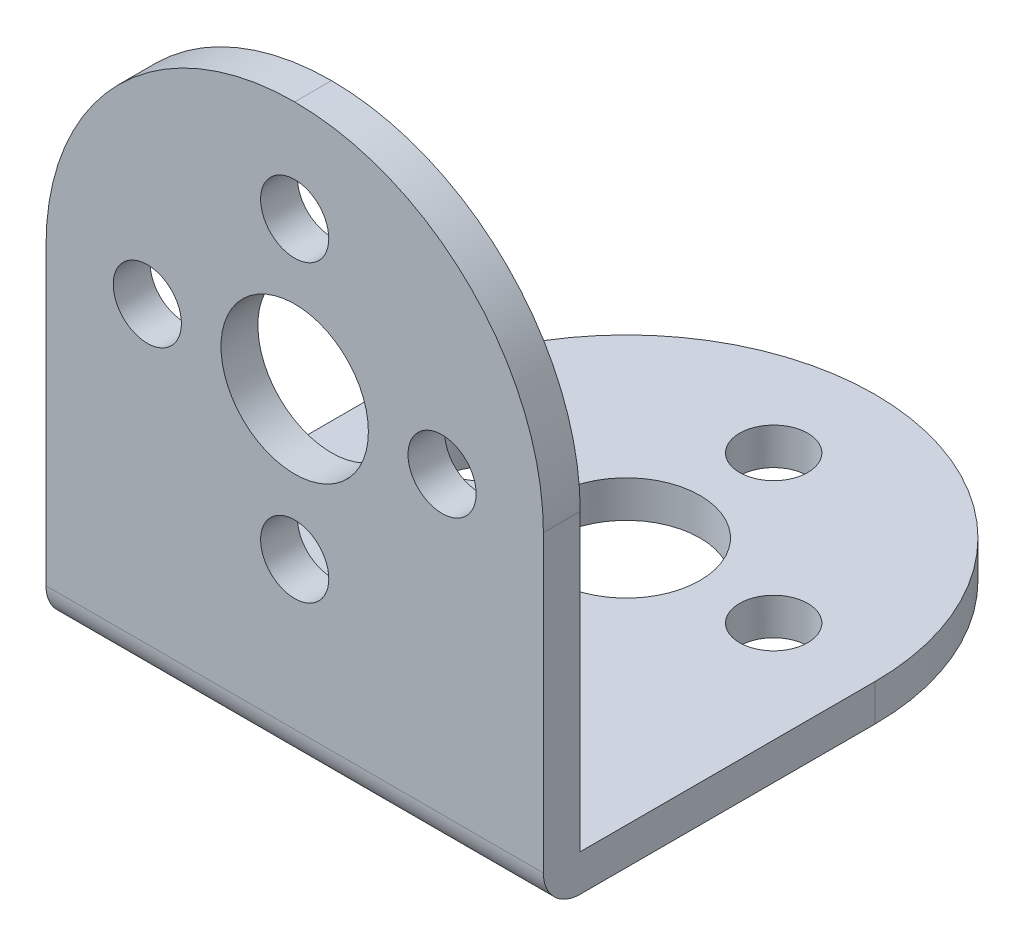
ISO-10303-21;
HEADER;
FILE_DESCRIPTION(('STEP AP214'),'2;1');
FILE_NAME('part.step','',(''),(''),'','','');
FILE_SCHEMA(('AUTOMOTIVE_DESIGN { 1 0 10303 214 1 1 1 1 }'));
ENDSEC;
DATA;
#1=APPLICATION_CONTEXT('core data for automotive mechanical design processes');
#2=APPLICATION_PROTOCOL_DEFINITION('international standard','automotive_design',2000,#1);
#3=PRODUCT_CONTEXT('',#1,'mechanical');
#4=PRODUCT('Part','Part','',(#3));
#5=PRODUCT_RELATED_PRODUCT_CATEGORY('part','',(#4));
#6=PRODUCT_DEFINITION_FORMATION('','',#4);
#7=PRODUCT_DEFINITION_CONTEXT('part definition',#1,'design');
#8=PRODUCT_DEFINITION('design','',#6,#7);
#9=PRODUCT_DEFINITION_SHAPE('','',#8);
#10=(LENGTH_UNIT() NAMED_UNIT(*) SI_UNIT(.MILLI.,.METRE.));
#11=(NAMED_UNIT(*) PLANE_ANGLE_UNIT() SI_UNIT($,.RADIAN.));
#12=(NAMED_UNIT(*) SI_UNIT($,.STERADIAN.) SOLID_ANGLE_UNIT());
#13=UNCERTAINTY_MEASURE_WITH_UNIT(LENGTH_MEASURE(1.E-05),#10,'distance_accuracy_value','');
#14=(GEOMETRIC_REPRESENTATION_CONTEXT(3) GLOBAL_UNCERTAINTY_ASSIGNED_CONTEXT((#13)) GLOBAL_UNIT_ASSIGNED_CONTEXT((#10,
#11,#12)) REPRESENTATION_CONTEXT('',''));
#15=CARTESIAN_POINT('',(0.,0.,0.));
#16=DIRECTION('',(0.,0.,1.));
#17=DIRECTION('',(1.,0.,0.));
#18=AXIS2_PLACEMENT_3D('',#15,#16,#17);
#19=CARTESIAN_POINT('',(-14.2564342321871,10.0253469559307,20.0384048243081));
#20=DIRECTION('',(0.,0.,1.));
#21=DIRECTION('',(0.,-1.,0.));
#22=AXIS2_PLACEMENT_3D('',#19,#20,#21);
#23=PLANE('',#22);
#24=CARTESIAN_POINT('',(-0.756434232187075,4.52534695593067,20.0384048243081));
#25=DIRECTION('',(0.,0.,1.));
#26=DIRECTION('',(1.,0.,0.));
#27=AXIS2_PLACEMENT_3D('',#24,#25,#26);
#28=CIRCLE('',#27,1.85);
#29=CARTESIAN_POINT('',(1.09356576781292,4.52534695593067,20.0384048243081));
#30=VERTEX_POINT('',#29);
#31=EDGE_CURVE('E150',#30,#30,#28,.T.);
#32=ORIENTED_EDGE('',*,*,#31,.F.);
#33=EDGE_LOOP('',(#32));
#34=FACE_BOUND('',#33,.T.);
#35=CARTESIAN_POINT('',(-0.756434232187075,-11.4746530440693,20.0384048243081));
#36=DIRECTION('',(0.,0.,1.));
#37=DIRECTION('',(1.,0.,0.));
#38=AXIS2_PLACEMENT_3D('',#35,#36,#37);
#39=CIRCLE('',#38,1.85);
#40=CARTESIAN_POINT('',(1.09356576781292,-11.4746530440693,20.0384048243081));
#41=VERTEX_POINT('',#40);
#42=EDGE_CURVE('E146',#41,#41,#39,.T.);
#43=ORIENTED_EDGE('',*,*,#42,.F.);
#44=EDGE_LOOP('',(#43));
#45=FACE_BOUND('',#44,.T.);
#46=CARTESIAN_POINT('',(-8.75643423218707,-3.47465304406933,20.0384048243081));
#47=DIRECTION('',(0.,0.,1.));
#48=DIRECTION('',(1.,0.,0.));
#49=AXIS2_PLACEMENT_3D('',#46,#47,#48);
#50=CIRCLE('',#49,1.85);
#51=CARTESIAN_POINT('',(-6.90643423218708,-3.47465304406933,20.0384048243081));
#52=VERTEX_POINT('',#51);
#53=EDGE_CURVE('E142',#52,#52,#50,.T.);
#54=ORIENTED_EDGE('',*,*,#53,.F.);
#55=EDGE_LOOP('',(#54));
#56=FACE_BOUND('',#55,.T.);
#57=CARTESIAN_POINT('',(7.24356576781292,-3.47465304406933,20.0384048243081));
#58=DIRECTION('',(0.,0.,1.));
#59=DIRECTION('',(1.,0.,0.));
#60=AXIS2_PLACEMENT_3D('',#57,#58,#59);
#61=CIRCLE('',#60,1.85);
#62=CARTESIAN_POINT('',(9.09356576781292,-3.47465304406933,20.0384048243081));
#63=VERTEX_POINT('',#62);
#64=EDGE_CURVE('E138',#63,#63,#61,.T.);
#65=ORIENTED_EDGE('',*,*,#64,.F.);
#66=EDGE_LOOP('',(#65));
#67=FACE_BOUND('',#66,.T.);
#68=CARTESIAN_POINT('',(-0.756434232187075,-3.47465304406933,20.0384048243081));
#69=DIRECTION('',(0.,0.,1.));
#70=DIRECTION('',(1.,0.,0.));
#71=AXIS2_PLACEMENT_3D('',#68,#69,#70);
#72=CIRCLE('',#71,4.);
#73=CARTESIAN_POINT('',(3.24356576781293,-3.47465304406933,20.0384048243081));
#74=VERTEX_POINT('',#73);
#75=EDGE_CURVE('E134',#74,#74,#72,.T.);
#76=ORIENTED_EDGE('',*,*,#75,.F.);
#77=EDGE_LOOP('',(#76));
#78=FACE_BOUND('',#77,.T.);
#79=DIRECTION('',(0.,-1.,0.));
#80=VECTOR('',#79,1.);
#81=CARTESIAN_POINT('',(-14.2564342321871,10.0253469559307,20.0384048243081));
#82=LINE('',#81,#80);
#83=CARTESIAN_POINT('',(-14.2564342321871,-3.47465304406933,20.0384048243081));
#84=VERTEX_POINT('',#83);
#85=CARTESIAN_POINT('',(-14.2564342321871,-19.4746530440693,20.0384048243081));
#86=VERTEX_POINT('',#85);
#87=EDGE_CURVE('E130',#84,#86,#82,.T.);
#88=ORIENTED_EDGE('',*,*,#87,.T.);
#89=DIRECTION('',(1.,0.,0.));
#90=VECTOR('',#89,1.);
#91=CARTESIAN_POINT('',(-14.2564342321871,-19.4746530440693,20.0384048243081));
#92=LINE('',#91,#90);
#93=CARTESIAN_POINT('',(12.7435657678129,-19.4746530440693,20.0384048243081));
#94=VERTEX_POINT('',#93);
#95=EDGE_CURVE('E182',#86,#94,#92,.T.);
#96=ORIENTED_EDGE('',*,*,#95,.T.);
#97=DIRECTION('',(0.,-1.,0.));
#98=VECTOR('',#97,1.);
#99=CARTESIAN_POINT('',(12.7435657678129,10.0253469559307,20.0384048243081));
#100=LINE('',#99,#98);
#101=CARTESIAN_POINT('',(12.7435657678129,-3.47465304406933,20.0384048243081));
#102=VERTEX_POINT('',#101);
#103=EDGE_CURVE('E123',#102,#94,#100,.T.);
#104=ORIENTED_EDGE('',*,*,#103,.F.);
#105=CARTESIAN_POINT('',(-0.756434232187075,-3.47465304406933,20.0384048243081));
#106=DIRECTION('',(0.,0.,1.));
#107=DIRECTION('',(0.,-1.,0.));
#108=AXIS2_PLACEMENT_3D('',#105,#106,#107);
#109=CIRCLE('',#108,13.5);
#110=CARTESIAN_POINT('',(-0.756434232187075,10.0253469559307,20.0384048243081));
#111=VERTEX_POINT('',#110);
#112=EDGE_CURVE('E153',#102,#111,#109,.T.);
#113=ORIENTED_EDGE('',*,*,#112,.T.);
#114=CARTESIAN_POINT('',(-0.756434232187075,-3.47465304406933,20.0384048243081));
#115=DIRECTION('',(0.,0.,1.));
#116=DIRECTION('',(0.,-1.,0.));
#117=AXIS2_PLACEMENT_3D('',#114,#115,#116);
#118=CIRCLE('',#117,13.5);
#119=EDGE_CURVE('E161',#111,#84,#118,.T.);
#120=ORIENTED_EDGE('',*,*,#119,.T.);
#121=EDGE_LOOP('',(#88,#96,#104,#113,#120));
#122=FACE_BOUND('',#121,.T.);
#123=ADVANCED_FACE('F24',(#34,#45,#56,#67,#78,#122),#23,.T.);
#124=CARTESIAN_POINT('',(-14.2564342321871,-19.4746530440693,18.0384048243081));
#125=DIRECTION('',(0.,0.,-1.));
#126=DIRECTION('',(0.,1.,0.));
#127=AXIS2_PLACEMENT_3D('',#124,#125,#126);
#128=PLANE('',#127);
#129=CARTESIAN_POINT('',(-0.756434232187075,4.52534695593067,18.0384048243081));
#130=DIRECTION('',(0.,0.,-1.));
#131=DIRECTION('',(0.,1.,0.));
#132=AXIS2_PLACEMENT_3D('',#129,#130,#131);
#133=CIRCLE('',#132,1.85);
#134=CARTESIAN_POINT('',(-0.756434232187075,6.37534695593067,18.0384048243081));
#135=VERTEX_POINT('',#134);
#136=EDGE_CURVE('E147',#135,#135,#133,.T.);
#137=ORIENTED_EDGE('',*,*,#136,.F.);
#138=EDGE_LOOP('',(#137));
#139=FACE_BOUND('',#138,.T.);
#140=CARTESIAN_POINT('',(-0.756434232187075,-11.4746530440693,18.0384048243081));
#141=DIRECTION('',(0.,0.,-1.));
#142=DIRECTION('',(0.,1.,0.));
#143=AXIS2_PLACEMENT_3D('',#140,#141,#142);
#144=CIRCLE('',#143,1.85);
#145=CARTESIAN_POINT('',(-0.756434232187075,-9.62465304406933,18.0384048243081));
#146=VERTEX_POINT('',#145);
#147=EDGE_CURVE('E143',#146,#146,#144,.T.);
#148=ORIENTED_EDGE('',*,*,#147,.F.);
#149=EDGE_LOOP('',(#148));
#150=FACE_BOUND('',#149,.T.);
#151=CARTESIAN_POINT('',(-8.75643423218707,-3.47465304406933,18.0384048243081));
#152=DIRECTION('',(0.,0.,-1.));
#153=DIRECTION('',(0.,1.,0.));
#154=AXIS2_PLACEMENT_3D('',#151,#152,#153);
#155=CIRCLE('',#154,1.85);
#156=CARTESIAN_POINT('',(-8.75643423218707,-1.62465304406933,18.0384048243081));
#157=VERTEX_POINT('',#156);
#158=EDGE_CURVE('E139',#157,#157,#155,.T.);
#159=ORIENTED_EDGE('',*,*,#158,.F.);
#160=EDGE_LOOP('',(#159));
#161=FACE_BOUND('',#160,.T.);
#162=CARTESIAN_POINT('',(7.24356576781292,-3.47465304406933,18.0384048243081));
#163=DIRECTION('',(0.,0.,-1.));
#164=DIRECTION('',(0.,1.,0.));
#165=AXIS2_PLACEMENT_3D('',#162,#163,#164);
#166=CIRCLE('',#165,1.85);
#167=CARTESIAN_POINT('',(7.24356576781292,-1.62465304406933,18.0384048243081));
#168=VERTEX_POINT('',#167);
#169=EDGE_CURVE('E135',#168,#168,#166,.T.);
#170=ORIENTED_EDGE('',*,*,#169,.F.);
#171=EDGE_LOOP('',(#170));
#172=FACE_BOUND('',#171,.T.);
#173=CARTESIAN_POINT('',(-0.756434232187075,-3.47465304406933,18.0384048243081));
#174=DIRECTION('',(0.,0.,-1.));
#175=DIRECTION('',(0.,1.,0.));
#176=AXIS2_PLACEMENT_3D('',#173,#174,#175);
#177=CIRCLE('',#176,4.);
#178=CARTESIAN_POINT('',(-0.756434232187075,0.525346955930675,18.0384048243081));
#179=VERTEX_POINT('',#178);
#180=EDGE_CURVE('E126',#179,#179,#177,.T.);
#181=ORIENTED_EDGE('',*,*,#180,.F.);
#182=EDGE_LOOP('',(#181));
#183=FACE_BOUND('',#182,.T.);
#184=DIRECTION('',(0.,1.,0.));
#185=VECTOR('',#184,1.);
#186=CARTESIAN_POINT('',(-14.2564342321871,-19.4746530440693,18.0384048243081));
#187=LINE('',#186,#185);
#188=CARTESIAN_POINT('',(-14.2564342321871,-19.4746530440693,18.0384048243081));
#189=VERTEX_POINT('',#188);
#190=CARTESIAN_POINT('',(-14.2564342321871,-3.47465304406933,18.0384048243081));
#191=VERTEX_POINT('',#190);
#192=EDGE_CURVE('E105',#189,#191,#187,.T.);
#193=ORIENTED_EDGE('',*,*,#192,.T.);
#194=CARTESIAN_POINT('',(-0.756434232187075,-3.47465304406933,18.0384048243081));
#195=DIRECTION('',(0.,0.,-1.));
#196=DIRECTION('',(0.,1.,0.));
#197=AXIS2_PLACEMENT_3D('',#194,#195,#196);
#198=CIRCLE('',#197,13.5);
#199=CARTESIAN_POINT('',(-0.756434232187075,10.0253469559307,18.0384048243081));
#200=VERTEX_POINT('',#199);
#201=EDGE_CURVE('E164',#191,#200,#198,.T.);
#202=ORIENTED_EDGE('',*,*,#201,.T.);
#203=CARTESIAN_POINT('',(-0.756434232187075,-3.47465304406933,18.0384048243081));
#204=DIRECTION('',(0.,0.,-1.));
#205=DIRECTION('',(0.,1.,0.));
#206=AXIS2_PLACEMENT_3D('',#203,#204,#205);
#207=CIRCLE('',#206,13.5);
#208=CARTESIAN_POINT('',(12.7435657678129,-3.47465304406933,18.0384048243081));
#209=VERTEX_POINT('',#208);
#210=EDGE_CURVE('E159',#200,#209,#207,.T.);
#211=ORIENTED_EDGE('',*,*,#210,.T.);
#212=DIRECTION('',(0.,1.,0.));
#213=VECTOR('',#212,1.);
#214=CARTESIAN_POINT('',(12.7435657678129,-19.4746530440693,18.0384048243081));
#215=LINE('',#214,#213);
#216=CARTESIAN_POINT('',(12.7435657678129,-19.4746530440693,18.0384048243081));
#217=VERTEX_POINT('',#216);
#218=EDGE_CURVE('E113',#217,#209,#215,.T.);
#219=ORIENTED_EDGE('',*,*,#218,.F.);
#220=DIRECTION('',(1.,0.,0.));
#221=VECTOR('',#220,1.);
#222=CARTESIAN_POINT('',(-14.2564342321871,-19.4746530440693,18.0384048243081));
#223=LINE('',#222,#221);
#224=EDGE_CURVE('E98',#189,#217,#223,.T.);
#225=ORIENTED_EDGE('',*,*,#224,.F.);
#226=EDGE_LOOP('',(#193,#202,#211,#219,#225));
#227=FACE_BOUND('',#226,.T.);
#228=ADVANCED_FACE('F110',(#139,#150,#161,#172,#183,#227),#128,.T.);
#229=CARTESIAN_POINT('',(-14.2564342321871,-19.4746530440693,-11.4615951756919));
#230=DIRECTION('',(0.,1.,0.));
#231=DIRECTION('',(0.,0.,1.));
#232=AXIS2_PLACEMENT_3D('',#229,#230,#231);
#233=PLANE('',#232);
#234=CARTESIAN_POINT('',(-0.756434232187075,-19.4746530440693,10.0384048243081));
#235=DIRECTION('',(0.,1.,0.));
#236=DIRECTION('',(0.,0.,1.));
#237=AXIS2_PLACEMENT_3D('',#234,#235,#236);
#238=CIRCLE('',#237,1.85);
#239=CARTESIAN_POINT('',(-0.756434232187075,-19.4746530440693,11.8884048243081));
#240=VERTEX_POINT('',#239);
#241=EDGE_CURVE('E278',#240,#240,#238,.T.);
#242=ORIENTED_EDGE('',*,*,#241,.F.);
#243=EDGE_LOOP('',(#242));
#244=FACE_BOUND('',#243,.T.);
#245=CARTESIAN_POINT('',(-0.756434232187075,-19.4746530440693,-5.96159517569185));
#246=DIRECTION('',(0.,1.,0.));
#247=DIRECTION('',(0.,0.,1.));
#248=AXIS2_PLACEMENT_3D('',#245,#246,#247);
#249=CIRCLE('',#248,1.85);
#250=CARTESIAN_POINT('',(-0.756434232187075,-19.4746530440693,-4.11159517569186));
#251=VERTEX_POINT('',#250);
#252=EDGE_CURVE('E288',#251,#251,#249,.T.);
#253=ORIENTED_EDGE('',*,*,#252,.F.);
#254=EDGE_LOOP('',(#253));
#255=FACE_BOUND('',#254,.T.);
#256=CARTESIAN_POINT('',(-8.75643423218707,-19.4746530440693,2.03840482430815));
#257=DIRECTION('',(0.,1.,0.));
#258=DIRECTION('',(0.,0.,1.));
#259=AXIS2_PLACEMENT_3D('',#256,#257,#258);
#260=CIRCLE('',#259,1.85);
#261=CARTESIAN_POINT('',(-8.75643423218707,-19.4746530440693,3.88840482430814));
#262=VERTEX_POINT('',#261);
#263=EDGE_CURVE('E294',#262,#262,#260,.T.);
#264=ORIENTED_EDGE('',*,*,#263,.F.);
#265=EDGE_LOOP('',(#264));
#266=FACE_BOUND('',#265,.T.);
#267=CARTESIAN_POINT('',(7.24356576781292,-19.4746530440693,2.03840482430815));
#268=DIRECTION('',(0.,1.,0.));
#269=DIRECTION('',(0.,0.,1.));
#270=AXIS2_PLACEMENT_3D('',#267,#268,#269);
#271=CIRCLE('',#270,1.85);
#272=CARTESIAN_POINT('',(7.24356576781292,-19.4746530440693,3.88840482430814));
#273=VERTEX_POINT('',#272);
#274=EDGE_CURVE('E300',#273,#273,#271,.T.);
#275=ORIENTED_EDGE('',*,*,#274,.F.);
#276=EDGE_LOOP('',(#275));
#277=FACE_BOUND('',#276,.T.);
#278=CARTESIAN_POINT('',(-0.756434232187075,-19.4746530440693,2.03840482430815));
#279=DIRECTION('',(0.,1.,0.));
#280=DIRECTION('',(0.,0.,1.));
#281=AXIS2_PLACEMENT_3D('',#278,#279,#280);
#282=CIRCLE('',#281,4.);
#283=CARTESIAN_POINT('',(-0.756434232187075,-19.4746530440693,6.03840482430815));
#284=VERTEX_POINT('',#283);
#285=EDGE_CURVE('E306',#284,#284,#282,.T.);
#286=ORIENTED_EDGE('',*,*,#285,.F.);
#287=EDGE_LOOP('',(#286));
#288=FACE_BOUND('',#287,.T.);
#289=CARTESIAN_POINT('',(-0.756434232187075,-19.4746530440693,2.03840482430814));
#290=DIRECTION('',(0.,1.,0.));
#291=DIRECTION('',(0.,0.,1.));
#292=AXIS2_PLACEMENT_3D('',#289,#290,#291);
#293=CIRCLE('',#292,13.5);
#294=CARTESIAN_POINT('',(12.7435657678129,-19.4746530440693,2.03840482430814));
#295=VERTEX_POINT('',#294);
#296=CARTESIAN_POINT('',(-0.756434232187075,-19.4746530440693,-11.4615951756919));
#297=VERTEX_POINT('',#296);
#298=EDGE_CURVE('E169',#295,#297,#293,.T.);
#299=ORIENTED_EDGE('',*,*,#298,.T.);
#300=CARTESIAN_POINT('',(-0.756434232187075,-19.4746530440693,2.03840482430814));
#301=DIRECTION('',(0.,1.,0.));
#302=DIRECTION('',(0.,0.,1.));
#303=AXIS2_PLACEMENT_3D('',#300,#301,#302);
#304=CIRCLE('',#303,13.5);
#305=CARTESIAN_POINT('',(-14.2564342321871,-19.4746530440693,2.03840482430814));
#306=VERTEX_POINT('',#305);
#307=EDGE_CURVE('E100',#297,#306,#304,.T.);
#308=ORIENTED_EDGE('',*,*,#307,.T.);
#309=DIRECTION('',(0.,0.,1.));
#310=VECTOR('',#309,1.);
#311=CARTESIAN_POINT('',(-14.2564342321871,-19.4746530440693,-11.4615951756919));
#312=LINE('',#311,#310);
#313=EDGE_CURVE('E93',#306,#189,#312,.T.);
#314=ORIENTED_EDGE('',*,*,#313,.T.);
#315=ORIENTED_EDGE('',*,*,#224,.T.);
#316=DIRECTION('',(0.,0.,1.));
#317=VECTOR('',#316,1.);
#318=CARTESIAN_POINT('',(12.7435657678129,-19.4746530440693,-11.4615951756919));
#319=LINE('',#318,#317);
#320=EDGE_CURVE('E128',#295,#217,#319,.T.);
#321=ORIENTED_EDGE('',*,*,#320,.F.);
#322=EDGE_LOOP('',(#299,#308,#314,#315,#321));
#323=FACE_BOUND('',#322,.T.);
#324=ADVANCED_FACE('F96',(#244,#255,#266,#277,#288,#323),#233,.T.);
#325=CARTESIAN_POINT('',(-14.2564342321871,-21.4746530440693,20.0384048243081));
#326=DIRECTION('',(0.,-1.,0.));
#327=DIRECTION('',(0.,0.,-1.));
#328=AXIS2_PLACEMENT_3D('',#325,#326,#327);
#329=PLANE('',#328);
#330=CARTESIAN_POINT('',(-0.756434232187075,-21.4746530440693,10.0384048243081));
#331=DIRECTION('',(0.,-1.,0.));
#332=DIRECTION('',(0.,0.,-1.));
#333=AXIS2_PLACEMENT_3D('',#330,#331,#332);
#334=CIRCLE('',#333,1.85);
#335=CARTESIAN_POINT('',(-0.756434232187075,-21.4746530440693,8.18840482430815));
#336=VERTEX_POINT('',#335);
#337=EDGE_CURVE('E281',#336,#336,#334,.T.);
#338=ORIENTED_EDGE('',*,*,#337,.F.);
#339=EDGE_LOOP('',(#338));
#340=FACE_BOUND('',#339,.T.);
#341=CARTESIAN_POINT('',(-0.756434232187075,-21.4746530440693,-5.96159517569185));
#342=DIRECTION('',(0.,-1.,0.));
#343=DIRECTION('',(0.,0.,-1.));
#344=AXIS2_PLACEMENT_3D('',#341,#342,#343);
#345=CIRCLE('',#344,1.85);
#346=CARTESIAN_POINT('',(-0.756434232187075,-21.4746530440693,-7.81159517569185));
#347=VERTEX_POINT('',#346);
#348=EDGE_CURVE('E283',#347,#347,#345,.T.);
#349=ORIENTED_EDGE('',*,*,#348,.F.);
#350=EDGE_LOOP('',(#349));
#351=FACE_BOUND('',#350,.T.);
#352=CARTESIAN_POINT('',(-8.75643423218707,-21.4746530440693,2.03840482430815));
#353=DIRECTION('',(0.,-1.,0.));
#354=DIRECTION('',(0.,0.,-1.));
#355=AXIS2_PLACEMENT_3D('',#352,#353,#354);
#356=CIRCLE('',#355,1.85);
#357=CARTESIAN_POINT('',(-8.75643423218707,-21.4746530440693,0.18840482430815));
#358=VERTEX_POINT('',#357);
#359=EDGE_CURVE('E291',#358,#358,#356,.T.);
#360=ORIENTED_EDGE('',*,*,#359,.F.);
#361=EDGE_LOOP('',(#360));
#362=FACE_BOUND('',#361,.T.);
#363=CARTESIAN_POINT('',(7.24356576781292,-21.4746530440693,2.03840482430815));
#364=DIRECTION('',(0.,-1.,0.));
#365=DIRECTION('',(0.,0.,-1.));
#366=AXIS2_PLACEMENT_3D('',#363,#364,#365);
#367=CIRCLE('',#366,1.85);
#368=CARTESIAN_POINT('',(7.24356576781292,-21.4746530440693,0.18840482430815));
#369=VERTEX_POINT('',#368);
#370=EDGE_CURVE('E297',#369,#369,#367,.T.);
#371=ORIENTED_EDGE('',*,*,#370,.F.);
#372=EDGE_LOOP('',(#371));
#373=FACE_BOUND('',#372,.T.);
#374=CARTESIAN_POINT('',(-0.756434232187075,-21.4746530440693,2.03840482430815));
#375=DIRECTION('',(0.,-1.,0.));
#376=DIRECTION('',(0.,0.,-1.));
#377=AXIS2_PLACEMENT_3D('',#374,#375,#376);
#378=CIRCLE('',#377,4.);
#379=CARTESIAN_POINT('',(-0.756434232187075,-21.4746530440693,-1.96159517569186));
#380=VERTEX_POINT('',#379);
#381=EDGE_CURVE('E303',#380,#380,#378,.T.);
#382=ORIENTED_EDGE('',*,*,#381,.F.);
#383=EDGE_LOOP('',(#382));
#384=FACE_BOUND('',#383,.T.);
#385=DIRECTION('',(0.,0.,-1.));
#386=VECTOR('',#385,1.);
#387=CARTESIAN_POINT('',(12.7435657678129,-21.4746530440693,20.0384048243081));
#388=LINE('',#387,#386);
#389=CARTESIAN_POINT('',(12.7435657678129,-21.4746530440693,18.0384048243081));
#390=VERTEX_POINT('',#389);
#391=CARTESIAN_POINT('',(12.7435657678129,-21.4746530440693,2.03840482430814));
#392=VERTEX_POINT('',#391);
#393=EDGE_CURVE('E125',#390,#392,#388,.T.);
#394=ORIENTED_EDGE('',*,*,#393,.F.);
#395=DIRECTION('',(1.,0.,0.));
#396=VECTOR('',#395,1.);
#397=CARTESIAN_POINT('',(-14.2564342321871,-21.4746530440693,18.0384048243081));
#398=LINE('',#397,#396);
#399=CARTESIAN_POINT('',(-14.2564342321871,-21.4746530440693,18.0384048243081));
#400=VERTEX_POINT('',#399);
#401=EDGE_CURVE('E32',#390,#400,#398,.F.);
#402=ORIENTED_EDGE('',*,*,#401,.T.);
#403=DIRECTION('',(0.,0.,-1.));
#404=VECTOR('',#403,1.);
#405=CARTESIAN_POINT('',(-14.2564342321871,-21.4746530440693,20.0384048243081));
#406=LINE('',#405,#404);
#407=CARTESIAN_POINT('',(-14.2564342321871,-21.4746530440693,2.03840482430814));
#408=VERTEX_POINT('',#407);
#409=EDGE_CURVE('E106',#400,#408,#406,.T.);
#410=ORIENTED_EDGE('',*,*,#409,.T.);
#411=CARTESIAN_POINT('',(-0.756434232187075,-21.4746530440693,2.03840482430814));
#412=DIRECTION('',(0.,-1.,0.));
#413=DIRECTION('',(0.,0.,-1.));
#414=AXIS2_PLACEMENT_3D('',#411,#412,#413);
#415=CIRCLE('',#414,13.5);
#416=CARTESIAN_POINT('',(-0.756434232187075,-21.4746530440693,-11.4615951756919));
#417=VERTEX_POINT('',#416);
#418=EDGE_CURVE('E180',#408,#417,#415,.T.);
#419=ORIENTED_EDGE('',*,*,#418,.T.);
#420=CARTESIAN_POINT('',(-0.756434232187075,-21.4746530440693,2.03840482430814));
#421=DIRECTION('',(0.,-1.,0.));
#422=DIRECTION('',(0.,0.,-1.));
#423=AXIS2_PLACEMENT_3D('',#420,#421,#422);
#424=CIRCLE('',#423,13.5);
#425=EDGE_CURVE('E174',#417,#392,#424,.T.);
#426=ORIENTED_EDGE('',*,*,#425,.T.);
#427=EDGE_LOOP('',(#394,#402,#410,#419,#426));
#428=FACE_BOUND('',#427,.T.);
#429=ADVANCED_FACE('F224',(#340,#351,#362,#373,#384,#428),#329,.T.);
#430=CARTESIAN_POINT('',(-14.2564342321871,-21.4746530440693,20.0384048243081));
#431=DIRECTION('',(1.,0.,0.));
#432=DIRECTION('',(0.,0.,-1.));
#433=AXIS2_PLACEMENT_3D('',#430,#431,#432);
#434=PLANE('',#433);
#435=ORIENTED_EDGE('',*,*,#409,.F.);
#436=CARTESIAN_POINT('',(-14.2564342321871,-19.4746530440693,18.0384048243081));
#437=DIRECTION('',(1.,0.,0.));
#438=DIRECTION('',(0.,0.,-1.));
#439=AXIS2_PLACEMENT_3D('',#436,#437,#438);
#440=CIRCLE('',#439,2.);
#441=EDGE_CURVE('E13',#400,#86,#440,.F.);
#442=ORIENTED_EDGE('',*,*,#441,.T.);
#443=ORIENTED_EDGE('',*,*,#87,.F.);
#444=DIRECTION('',(0.,0.,1.));
#445=VECTOR('',#444,1.);
#446=CARTESIAN_POINT('',(-14.2564342321871,-3.47465304406933,18.0384048243081));
#447=LINE('',#446,#445);
#448=EDGE_CURVE('E119',#84,#191,#447,.F.);
#449=ORIENTED_EDGE('',*,*,#448,.T.);
#450=ORIENTED_EDGE('',*,*,#192,.F.);
#451=ORIENTED_EDGE('',*,*,#313,.F.);
#452=DIRECTION('',(0.,1.,0.));
#453=VECTOR('',#452,1.);
#454=CARTESIAN_POINT('',(-14.2564342321871,-21.4746530440693,2.03840482430814));
#455=LINE('',#454,#453);
#456=EDGE_CURVE('E178',#306,#408,#455,.F.);
#457=ORIENTED_EDGE('',*,*,#456,.T.);
#458=EDGE_LOOP('',(#435,#442,#443,#449,#450,#451,#457));
#459=FACE_BOUND('',#458,.T.);
#460=ADVANCED_FACE('F116',(#459),#434,.F.);
#461=CARTESIAN_POINT('',(12.7435657678129,-21.4746530440693,20.0384048243081));
#462=DIRECTION('',(1.,0.,0.));
#463=DIRECTION('',(0.,0.,-1.));
#464=AXIS2_PLACEMENT_3D('',#461,#462,#463);
#465=PLANE('',#464);
#466=ORIENTED_EDGE('',*,*,#103,.T.);
#467=CARTESIAN_POINT('',(12.7435657678129,-19.4746530440693,18.0384048243081));
#468=DIRECTION('',(1.,0.,0.));
#469=DIRECTION('',(0.,0.,-1.));
#470=AXIS2_PLACEMENT_3D('',#467,#468,#469);
#471=CIRCLE('',#470,2.);
#472=EDGE_CURVE('E46',#94,#390,#471,.T.);
#473=ORIENTED_EDGE('',*,*,#472,.T.);
#474=ORIENTED_EDGE('',*,*,#393,.T.);
#475=DIRECTION('',(0.,1.,0.));
#476=VECTOR('',#475,1.);
#477=CARTESIAN_POINT('',(12.7435657678129,-21.4746530440693,2.03840482430814));
#478=LINE('',#477,#476);
#479=EDGE_CURVE('E166',#392,#295,#478,.T.);
#480=ORIENTED_EDGE('',*,*,#479,.T.);
#481=ORIENTED_EDGE('',*,*,#320,.T.);
#482=ORIENTED_EDGE('',*,*,#218,.T.);
#483=DIRECTION('',(0.,0.,1.));
#484=VECTOR('',#483,1.);
#485=CARTESIAN_POINT('',(12.7435657678129,-3.47465304406933,20.0384048243081));
#486=LINE('',#485,#484);
#487=EDGE_CURVE('E114',#209,#102,#486,.T.);
#488=ORIENTED_EDGE('',*,*,#487,.T.);
#489=EDGE_LOOP('',(#466,#473,#474,#480,#481,#482,#488));
#490=FACE_BOUND('',#489,.T.);
#491=ADVANCED_FACE('F191',(#490),#465,.T.);
#492=CARTESIAN_POINT('',(-0.756434232187075,-3.47465304406933,-11.4615951756919));
#493=DIRECTION('',(0.,0.,1.));
#494=DIRECTION('',(1.,0.,0.));
#495=AXIS2_PLACEMENT_3D('',#492,#493,#494);
#496=CYLINDRICAL_SURFACE('',#495,4.);
#497=ORIENTED_EDGE('',*,*,#180,.T.);
#498=EDGE_LOOP('',(#497));
#499=FACE_BOUND('',#498,.T.);
#500=ORIENTED_EDGE('',*,*,#75,.T.);
#501=EDGE_LOOP('',(#500));
#502=FACE_BOUND('',#501,.T.);
#503=ADVANCED_FACE('F233',(#499,#502),#496,.F.);
#504=CARTESIAN_POINT('',(7.24356576781292,-3.47465304406933,-11.4615951756919));
#505=DIRECTION('',(0.,0.,1.));
#506=DIRECTION('',(1.,0.,0.));
#507=AXIS2_PLACEMENT_3D('',#504,#505,#506);
#508=CYLINDRICAL_SURFACE('',#507,1.85);
#509=ORIENTED_EDGE('',*,*,#169,.T.);
#510=EDGE_LOOP('',(#509));
#511=FACE_BOUND('',#510,.T.);
#512=ORIENTED_EDGE('',*,*,#64,.T.);
#513=EDGE_LOOP('',(#512));
#514=FACE_BOUND('',#513,.T.);
#515=ADVANCED_FACE('F238',(#511,#514),#508,.F.);
#516=CARTESIAN_POINT('',(-8.75643423218707,-3.47465304406933,-11.4615951756919));
#517=DIRECTION('',(0.,0.,1.));
#518=DIRECTION('',(1.,0.,0.));
#519=AXIS2_PLACEMENT_3D('',#516,#517,#518);
#520=CYLINDRICAL_SURFACE('',#519,1.85);
#521=ORIENTED_EDGE('',*,*,#158,.T.);
#522=EDGE_LOOP('',(#521));
#523=FACE_BOUND('',#522,.T.);
#524=ORIENTED_EDGE('',*,*,#53,.T.);
#525=EDGE_LOOP('',(#524));
#526=FACE_BOUND('',#525,.T.);
#527=ADVANCED_FACE('F242',(#523,#526),#520,.F.);
#528=CARTESIAN_POINT('',(-0.756434232187075,-11.4746530440693,-11.4615951756919));
#529=DIRECTION('',(0.,0.,1.));
#530=DIRECTION('',(1.,0.,0.));
#531=AXIS2_PLACEMENT_3D('',#528,#529,#530);
#532=CYLINDRICAL_SURFACE('',#531,1.85);
#533=ORIENTED_EDGE('',*,*,#147,.T.);
#534=EDGE_LOOP('',(#533));
#535=FACE_BOUND('',#534,.T.);
#536=ORIENTED_EDGE('',*,*,#42,.T.);
#537=EDGE_LOOP('',(#536));
#538=FACE_BOUND('',#537,.T.);
#539=ADVANCED_FACE('F246',(#535,#538),#532,.F.);
#540=CARTESIAN_POINT('',(-0.756434232187075,4.52534695593067,-11.4615951756919));
#541=DIRECTION('',(0.,0.,1.));
#542=DIRECTION('',(1.,0.,0.));
#543=AXIS2_PLACEMENT_3D('',#540,#541,#542);
#544=CYLINDRICAL_SURFACE('',#543,1.85);
#545=ORIENTED_EDGE('',*,*,#136,.T.);
#546=EDGE_LOOP('',(#545));
#547=FACE_BOUND('',#546,.T.);
#548=ORIENTED_EDGE('',*,*,#31,.T.);
#549=EDGE_LOOP('',(#548));
#550=FACE_BOUND('',#549,.T.);
#551=ADVANCED_FACE('F250',(#547,#550),#544,.F.);
#552=CARTESIAN_POINT('',(-0.756434232187075,10.0253469559307,2.03840482430815));
#553=DIRECTION('',(0.,-1.,0.));
#554=DIRECTION('',(0.,0.,-1.));
#555=AXIS2_PLACEMENT_3D('',#552,#553,#554);
#556=CYLINDRICAL_SURFACE('',#555,4.);
#557=ORIENTED_EDGE('',*,*,#285,.T.);
#558=EDGE_LOOP('',(#557));
#559=FACE_BOUND('',#558,.T.);
#560=ORIENTED_EDGE('',*,*,#381,.T.);
#561=EDGE_LOOP('',(#560));
#562=FACE_BOUND('',#561,.T.);
#563=ADVANCED_FACE('F254',(#559,#562),#556,.F.);
#564=CARTESIAN_POINT('',(7.24356576781292,10.0253469559307,2.03840482430815));
#565=DIRECTION('',(0.,-1.,0.));
#566=DIRECTION('',(0.,0.,-1.));
#567=AXIS2_PLACEMENT_3D('',#564,#565,#566);
#568=CYLINDRICAL_SURFACE('',#567,1.85);
#569=ORIENTED_EDGE('',*,*,#274,.T.);
#570=EDGE_LOOP('',(#569));
#571=FACE_BOUND('',#570,.T.);
#572=ORIENTED_EDGE('',*,*,#370,.T.);
#573=EDGE_LOOP('',(#572));
#574=FACE_BOUND('',#573,.T.);
#575=ADVANCED_FACE('F258',(#571,#574),#568,.F.);
#576=CARTESIAN_POINT('',(-8.75643423218707,10.0253469559307,2.03840482430815));
#577=DIRECTION('',(0.,-1.,0.));
#578=DIRECTION('',(0.,0.,-1.));
#579=AXIS2_PLACEMENT_3D('',#576,#577,#578);
#580=CYLINDRICAL_SURFACE('',#579,1.85);
#581=ORIENTED_EDGE('',*,*,#263,.T.);
#582=EDGE_LOOP('',(#581));
#583=FACE_BOUND('',#582,.T.);
#584=ORIENTED_EDGE('',*,*,#359,.T.);
#585=EDGE_LOOP('',(#584));
#586=FACE_BOUND('',#585,.T.);
#587=ADVANCED_FACE('F262',(#583,#586),#580,.F.);
#588=CARTESIAN_POINT('',(-0.756434232187075,10.0253469559307,-5.96159517569185));
#589=DIRECTION('',(0.,-1.,0.));
#590=DIRECTION('',(0.,0.,-1.));
#591=AXIS2_PLACEMENT_3D('',#588,#589,#590);
#592=CYLINDRICAL_SURFACE('',#591,1.85);
#593=ORIENTED_EDGE('',*,*,#252,.T.);
#594=EDGE_LOOP('',(#593));
#595=FACE_BOUND('',#594,.T.);
#596=ORIENTED_EDGE('',*,*,#348,.T.);
#597=EDGE_LOOP('',(#596));
#598=FACE_BOUND('',#597,.T.);
#599=ADVANCED_FACE('F266',(#595,#598),#592,.F.);
#600=CARTESIAN_POINT('',(-0.756434232187075,10.0253469559307,10.0384048243081));
#601=DIRECTION('',(0.,-1.,0.));
#602=DIRECTION('',(0.,0.,-1.));
#603=AXIS2_PLACEMENT_3D('',#600,#601,#602);
#604=CYLINDRICAL_SURFACE('',#603,1.85);
#605=ORIENTED_EDGE('',*,*,#241,.T.);
#606=EDGE_LOOP('',(#605));
#607=FACE_BOUND('',#606,.T.);
#608=ORIENTED_EDGE('',*,*,#337,.T.);
#609=EDGE_LOOP('',(#608));
#610=FACE_BOUND('',#609,.T.);
#611=ADVANCED_FACE('F211',(#607,#610),#604,.F.);
#612=CARTESIAN_POINT('',(-0.756434232187075,-3.47465304406933,20.0384048243081));
#613=DIRECTION('',(0.,0.,1.));
#614=DIRECTION('',(1.,0.,0.));
#615=AXIS2_PLACEMENT_3D('',#612,#613,#614);
#616=CYLINDRICAL_SURFACE('',#615,13.5);
#617=ORIENTED_EDGE('',*,*,#210,.F.);
#618=DIRECTION('',(0.,0.,1.));
#619=VECTOR('',#618,1.);
#620=CARTESIAN_POINT('',(-0.756434232187075,10.0253469559307,18.0384048243081));
#621=LINE('',#620,#619);
#622=EDGE_CURVE('E156',#111,#200,#621,.F.);
#623=ORIENTED_EDGE('',*,*,#622,.F.);
#624=ORIENTED_EDGE('',*,*,#112,.F.);
#625=ORIENTED_EDGE('',*,*,#487,.F.);
#626=EDGE_LOOP('',(#617,#623,#624,#625));
#627=FACE_BOUND('',#626,.T.);
#628=ADVANCED_FACE('F195',(#627),#616,.T.);
#629=CARTESIAN_POINT('',(-0.756434232187075,-3.47465304406933,18.0384048243081));
#630=DIRECTION('',(0.,0.,-1.));
#631=DIRECTION('',(-1.,0.,0.));
#632=AXIS2_PLACEMENT_3D('',#629,#630,#631);
#633=CYLINDRICAL_SURFACE('',#632,13.5);
#634=ORIENTED_EDGE('',*,*,#201,.F.);
#635=ORIENTED_EDGE('',*,*,#448,.F.);
#636=ORIENTED_EDGE('',*,*,#119,.F.);
#637=ORIENTED_EDGE('',*,*,#622,.T.);
#638=EDGE_LOOP('',(#634,#635,#636,#637));
#639=FACE_BOUND('',#638,.T.);
#640=ADVANCED_FACE('F199',(#639),#633,.T.);
#641=CARTESIAN_POINT('',(-0.756434232187075,-21.4746530440693,2.03840482430814));
#642=DIRECTION('',(0.,1.,0.));
#643=DIRECTION('',(0.,0.,1.));
#644=AXIS2_PLACEMENT_3D('',#641,#642,#643);
#645=CYLINDRICAL_SURFACE('',#644,13.5);
#646=ORIENTED_EDGE('',*,*,#425,.F.);
#647=DIRECTION('',(0.,1.,0.));
#648=VECTOR('',#647,1.);
#649=CARTESIAN_POINT('',(-0.756434232187075,-21.4746530440693,-11.4615951756919));
#650=LINE('',#649,#648);
#651=EDGE_CURVE('E171',#297,#417,#650,.F.);
#652=ORIENTED_EDGE('',*,*,#651,.F.);
#653=ORIENTED_EDGE('',*,*,#298,.F.);
#654=ORIENTED_EDGE('',*,*,#479,.F.);
#655=EDGE_LOOP('',(#646,#652,#653,#654));
#656=FACE_BOUND('',#655,.T.);
#657=ADVANCED_FACE('F201',(#656),#645,.T.);
#658=CARTESIAN_POINT('',(-0.756434232187075,-21.4746530440693,2.03840482430814));
#659=DIRECTION('',(0.,-1.,0.));
#660=DIRECTION('',(0.,0.,-1.));
#661=AXIS2_PLACEMENT_3D('',#658,#659,#660);
#662=CYLINDRICAL_SURFACE('',#661,13.5);
#663=ORIENTED_EDGE('',*,*,#418,.F.);
#664=ORIENTED_EDGE('',*,*,#456,.F.);
#665=ORIENTED_EDGE('',*,*,#307,.F.);
#666=ORIENTED_EDGE('',*,*,#651,.T.);
#667=EDGE_LOOP('',(#663,#664,#665,#666));
#668=FACE_BOUND('',#667,.T.);
#669=ADVANCED_FACE('F208',(#668),#662,.T.);
#670=CARTESIAN_POINT('',(-14.2564342321871,-19.4746530440693,18.0384048243081));
#671=DIRECTION('',(1.,0.,0.));
#672=DIRECTION('',(0.,0.,-1.));
#673=AXIS2_PLACEMENT_3D('',#670,#671,#672);
#674=CYLINDRICAL_SURFACE('',#673,2.);
#675=ORIENTED_EDGE('',*,*,#441,.F.);
#676=ORIENTED_EDGE('',*,*,#401,.F.);
#677=ORIENTED_EDGE('',*,*,#472,.F.);
#678=ORIENTED_EDGE('',*,*,#95,.F.);
#679=EDGE_LOOP('',(#675,#676,#677,#678));
#680=FACE_BOUND('',#679,.T.);
#681=ADVANCED_FACE('F26',(#680),#674,.T.);
#682=CLOSED_SHELL('',(#123,#228,#324,#429,#460,#491,#503,#515,#527,#539,#551,#563,#575,#587,
#599,#611,#628,#640,#657,#669,#681));
#683=MANIFOLD_SOLID_BREP('B1',#682);
#684=ADVANCED_BREP_SHAPE_REPRESENTATION('',(#18,#683),#14);
#685=SHAPE_DEFINITION_REPRESENTATION(#9,#684);
ENDSEC;
END-ISO-10303-21;
